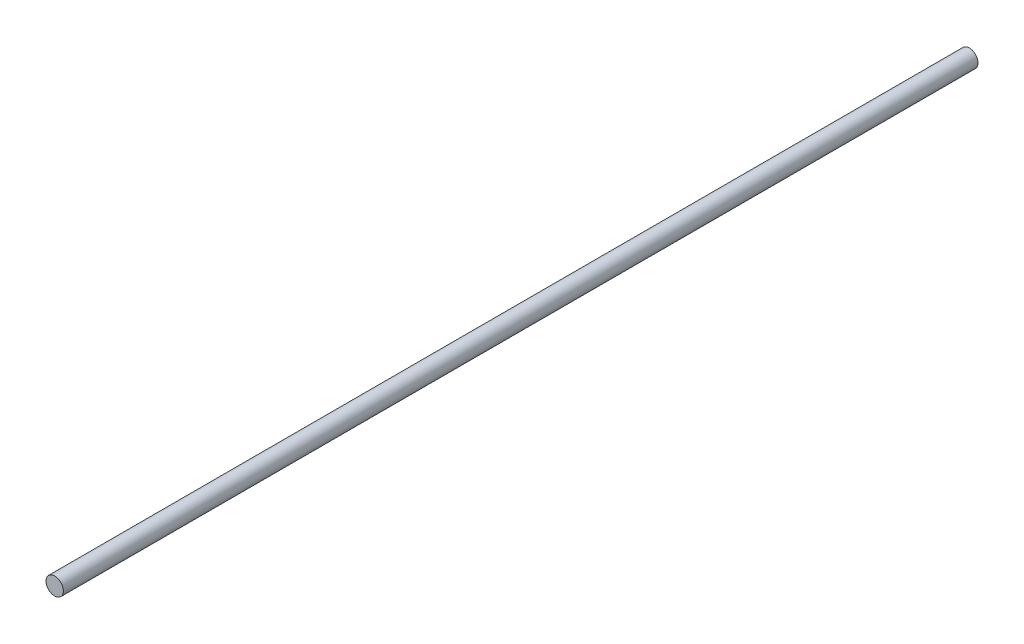
ISO-10303-21;
HEADER;
FILE_DESCRIPTION(('STEP AP214'),'2;1');
FILE_NAME('part.step','',(''),(''),'','','');
FILE_SCHEMA(('AUTOMOTIVE_DESIGN { 1 0 10303 214 1 1 1 1 }'));
ENDSEC;
DATA;
#1=APPLICATION_CONTEXT('core data for automotive mechanical design processes');
#2=APPLICATION_PROTOCOL_DEFINITION('international standard','automotive_design',2000,#1);
#3=PRODUCT_CONTEXT('',#1,'mechanical');
#4=PRODUCT('Part','Part','',(#3));
#5=PRODUCT_RELATED_PRODUCT_CATEGORY('part','',(#4));
#6=PRODUCT_DEFINITION_FORMATION('','',#4);
#7=PRODUCT_DEFINITION_CONTEXT('part definition',#1,'design');
#8=PRODUCT_DEFINITION('design','',#6,#7);
#9=PRODUCT_DEFINITION_SHAPE('','',#8);
#10=(LENGTH_UNIT() NAMED_UNIT(*) SI_UNIT(.MILLI.,.METRE.));
#11=(NAMED_UNIT(*) PLANE_ANGLE_UNIT() SI_UNIT($,.RADIAN.));
#12=(NAMED_UNIT(*) SI_UNIT($,.STERADIAN.) SOLID_ANGLE_UNIT());
#13=UNCERTAINTY_MEASURE_WITH_UNIT(LENGTH_MEASURE(1.E-05),#10,'distance_accuracy_value','');
#14=(GEOMETRIC_REPRESENTATION_CONTEXT(3) GLOBAL_UNCERTAINTY_ASSIGNED_CONTEXT((#13)) GLOBAL_UNIT_ASSIGNED_CONTEXT((#10,
#11,#12)) REPRESENTATION_CONTEXT('',''));
#15=CARTESIAN_POINT('',(0.,0.,0.));
#16=DIRECTION('',(0.,0.,1.));
#17=DIRECTION('',(1.,0.,0.));
#18=AXIS2_PLACEMENT_3D('',#15,#16,#17);
#19=CARTESIAN_POINT('',(0.,0.,19.1000004740064));
#20=DIRECTION('',(0.,0.,-1.));
#21=DIRECTION('',(-1.,0.,0.));
#22=AXIS2_PLACEMENT_3D('',#19,#20,#21);
#23=PLANE('',#22);
#24=CARTESIAN_POINT('',(0.,0.,19.1000004740064));
#25=DIRECTION('',(0.,0.,1.));
#26=DIRECTION('',(1.,0.,0.));
#27=AXIS2_PLACEMENT_3D('',#24,#25,#26);
#28=CIRCLE('',#27,4.);
#29=CARTESIAN_POINT('',(4.,0.,19.1000004740064));
#30=VERTEX_POINT('',#29);
#31=EDGE_CURVE('E10',#30,#30,#28,.T.);
#32=ORIENTED_EDGE('',*,*,#31,.T.);
#33=EDGE_LOOP('',(#32));
#34=FACE_BOUND('',#33,.T.);
#35=ADVANCED_FACE('F33',(#34),#23,.F.);
#36=CARTESIAN_POINT('',(0.,0.,19.1000004740064));
#37=DIRECTION('',(0.,0.,1.));
#38=DIRECTION('',(1.,0.,0.));
#39=AXIS2_PLACEMENT_3D('',#36,#37,#38);
#40=CYLINDRICAL_SURFACE('',#39,4.);
#41=ORIENTED_EDGE('',*,*,#31,.F.);
#42=EDGE_LOOP('',(#41));
#43=FACE_BOUND('',#42,.T.);
#44=CARTESIAN_POINT('',(0.,0.,-401.300000474007));
#45=DIRECTION('',(0.,0.,1.));
#46=DIRECTION('',(1.,0.,0.));
#47=AXIS2_PLACEMENT_3D('',#44,#45,#46);
#48=CIRCLE('',#47,4.);
#49=CARTESIAN_POINT('',(4.,0.,-401.300000474007));
#50=VERTEX_POINT('',#49);
#51=EDGE_CURVE('E39',#50,#50,#48,.T.);
#52=ORIENTED_EDGE('',*,*,#51,.T.);
#53=EDGE_LOOP('',(#52));
#54=FACE_BOUND('',#53,.T.);
#55=ADVANCED_FACE('F45',(#43,#54),#40,.T.);
#56=CARTESIAN_POINT('',(0.,0.,-401.300000474007));
#57=DIRECTION('',(0.,0.,1.));
#58=DIRECTION('',(1.,0.,0.));
#59=AXIS2_PLACEMENT_3D('',#56,#57,#58);
#60=PLANE('',#59);
#61=ORIENTED_EDGE('',*,*,#51,.F.);
#62=EDGE_LOOP('',(#61));
#63=FACE_BOUND('',#62,.T.);
#64=ADVANCED_FACE('F47',(#63),#60,.F.);
#65=CLOSED_SHELL('',(#35,#55,#64));
#66=MANIFOLD_SOLID_BREP('B2',#65);
#67=ADVANCED_BREP_SHAPE_REPRESENTATION('',(#18,#66),#14);
#68=SHAPE_DEFINITION_REPRESENTATION(#9,#67);
ENDSEC;
END-ISO-10303-21;
